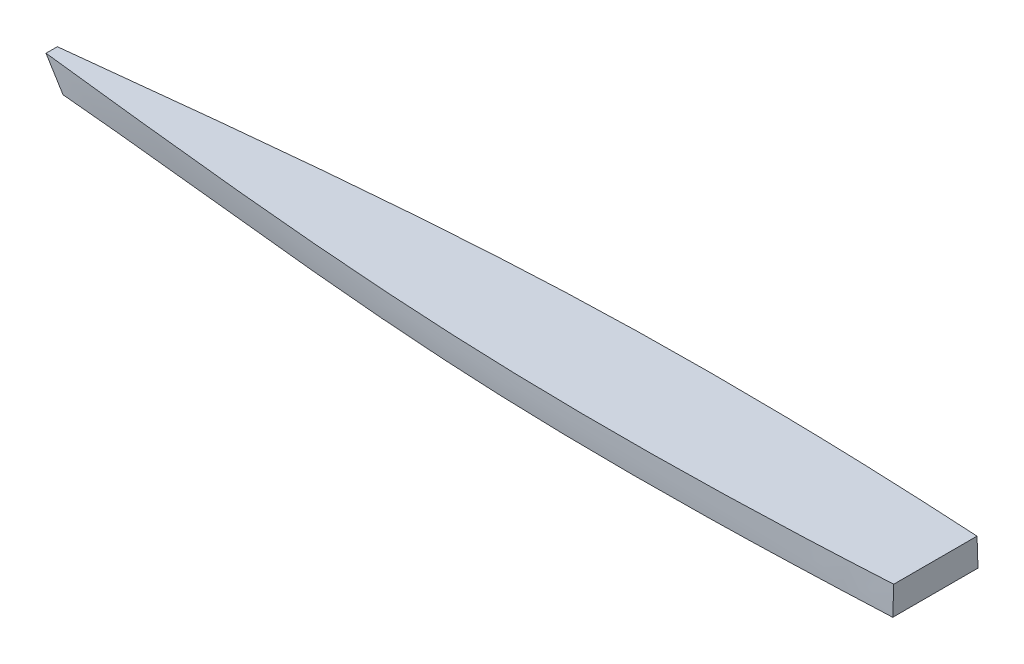
ISO-10303-21;
HEADER;
FILE_DESCRIPTION(('STEP AP214'),'2;1');
FILE_NAME('part.step','',(''),(''),'','','');
FILE_SCHEMA(('AUTOMOTIVE_DESIGN { 1 0 10303 214 1 1 1 1 }'));
ENDSEC;
DATA;
#1=APPLICATION_CONTEXT('core data for automotive mechanical design processes');
#2=APPLICATION_PROTOCOL_DEFINITION('international standard','automotive_design',2000,#1);
#3=PRODUCT_CONTEXT('',#1,'mechanical');
#4=PRODUCT('Part','Part','',(#3));
#5=PRODUCT_RELATED_PRODUCT_CATEGORY('part','',(#4));
#6=PRODUCT_DEFINITION_FORMATION('','',#4);
#7=PRODUCT_DEFINITION_CONTEXT('part definition',#1,'design');
#8=PRODUCT_DEFINITION('design','',#6,#7);
#9=PRODUCT_DEFINITION_SHAPE('','',#8);
#10=(LENGTH_UNIT() NAMED_UNIT(*) SI_UNIT(.MILLI.,.METRE.));
#11=(NAMED_UNIT(*) PLANE_ANGLE_UNIT() SI_UNIT($,.RADIAN.));
#12=(NAMED_UNIT(*) SI_UNIT($,.STERADIAN.) SOLID_ANGLE_UNIT());
#13=UNCERTAINTY_MEASURE_WITH_UNIT(LENGTH_MEASURE(1.E-05),#10,'distance_accuracy_value','');
#14=(GEOMETRIC_REPRESENTATION_CONTEXT(3) GLOBAL_UNCERTAINTY_ASSIGNED_CONTEXT((#13)) GLOBAL_UNIT_ASSIGNED_CONTEXT((#10,
#11,#12)) REPRESENTATION_CONTEXT('',''));
#15=CARTESIAN_POINT('',(0.,0.,0.));
#16=DIRECTION('',(0.,0.,1.));
#17=DIRECTION('',(1.,0.,0.));
#18=AXIS2_PLACEMENT_3D('',#15,#16,#17);
#19=CARTESIAN_POINT('',(0.,37.999248554247,0.));
#20=DIRECTION('',(0.,1.,0.));
#21=DIRECTION('',(-1.,0.,0.));
#22=AXIS2_PLACEMENT_3D('',#19,#20,#21);
#23=PLANE('',#22);
#24=DIRECTION('',(0.,0.,1.));
#25=VECTOR('',#24,1.);
#26=CARTESIAN_POINT('',(553.780953203146,37.999248554247,55.5625006612436));
#27=LINE('',#26,#25);
#28=CARTESIAN_POINT('',(553.780953203146,37.9992485520829,-57.5953656252869));
#29=VERTEX_POINT('',#28);
#30=CARTESIAN_POINT('',(553.780953203146,37.9992485520829,57.5953669477741));
#31=VERTEX_POINT('',#30);
#32=EDGE_CURVE('E93',#29,#31,#27,.T.);
#33=ORIENTED_EDGE('',*,*,#32,.T.);
#34=CARTESIAN_POINT('',(553.780953203146,37.9992485526515,57.5953671183876));
#35=CARTESIAN_POINT('',(548.773863775971,37.999248553659,57.824358610984));
#36=CARTESIAN_POINT('',(543.766651202168,37.9992485540859,58.0506555824567));
#37=CARTESIAN_POINT('',(533.751961357981,37.999248554408,58.4973462605181));
#38=CARTESIAN_POINT('',(528.744484087519,37.9992485543032,58.7177399653521));
#39=CARTESIAN_POINT('',(513.721638554495,37.9992485541346,59.3692943631397));
#40=CARTESIAN_POINT('',(503.705850107362,37.9992485542169,59.7908286362804));
#41=CARTESIAN_POINT('',(483.672408576738,37.9992485542771,60.6044770850778));
#42=CARTESIAN_POINT('',(473.654755413547,37.9992485542551,60.9965893028213));
#43=CARTESIAN_POINT('',(453.61818848432,37.9992485542389,61.7479100720035));
#44=CARTESIAN_POINT('',(443.59927471538,37.9992485542448,62.1071185461973));
#45=CARTESIAN_POINT('',(423.558710673163,37.9992485542491,62.7894791214365));
#46=CARTESIAN_POINT('',(413.537060214784,37.9992485542476,63.1126258130186));
#47=CARTESIAN_POINT('',(393.492574065518,37.9992485542464,63.7198070272983));
#48=CARTESIAN_POINT('',(383.46973837394,37.9992485542468,64.0038415270844));
#49=CARTESIAN_POINT('',(353.39953527617,37.9992485542474,64.7929838819326));
#50=CARTESIAN_POINT('',(333.35045803407,37.9992485542471,65.2351310707742));
#51=CARTESIAN_POINT('',(293.248864842879,37.9992485542469,65.9300341238479));
#52=CARTESIAN_POINT('',(273.196348872376,37.9992485542469,66.1827887626213));
#53=CARTESIAN_POINT('',(233.089626123552,37.999248554247,66.478297978267));
#54=CARTESIAN_POINT('',(213.035419344502,37.999248554247,66.5210524642347));
#55=CARTESIAN_POINT('',(182.952007699737,37.999248554247,66.4121924269231));
#56=CARTESIAN_POINT('',(172.922439422535,37.999248554247,66.347052401767));
#57=CARTESIAN_POINT('',(152.863846813173,37.999248554247,66.1564458725016));
#58=CARTESIAN_POINT('',(142.83482248177,37.999248554247,66.0309792864952));
#59=CARTESIAN_POINT('',(122.777766392741,37.999248554247,65.7170429928329));
#60=CARTESIAN_POINT('',(112.749734634197,37.999248554247,65.5285733439867));
#61=CARTESIAN_POINT('',(92.6950966983782,37.999248554247,65.0858893690443));
#62=CARTESIAN_POINT('',(82.6684905238253,37.999248554247,64.8316749190322));
#63=CARTESIAN_POINT('',(62.6179441570982,37.999248554247,64.2547091505872));
#64=CARTESIAN_POINT('',(52.5940038276793,37.999248554247,63.9319626177642));
#65=CARTESIAN_POINT('',(32.5486620068867,37.999248554247,63.2150243452051));
#66=CARTESIAN_POINT('',(22.527260518186,37.999248554247,62.8208325305578));
#67=CARTESIAN_POINT('',(2.48770007210905,37.999248554247,61.9580362865375));
#68=CARTESIAN_POINT('',(-7.53045890132251,37.999248554247,61.4894322314422));
#69=CARTESIAN_POINT('',(-27.5627845177742,37.999248554247,60.4746976271747));
#70=CARTESIAN_POINT('',(-37.576951183482,37.999248554247,59.9285675250541));
#71=CARTESIAN_POINT('',(-60.9367980204662,37.999248554247,58.5694000729219));
#72=CARTESIAN_POINT('',(-74.2808337681335,37.999248554247,57.7280591879273));
#73=CARTESIAN_POINT('',(-100.961062938043,37.999248554247,55.9279722539985));
#74=CARTESIAN_POINT('',(-114.297256284012,37.999248554247,54.9692250815748));
#75=CARTESIAN_POINT('',(-140.961708819366,37.999248554247,52.947102534316));
#76=CARTESIAN_POINT('',(-154.289967990141,37.999248554247,51.8837269150418));
#77=CARTESIAN_POINT('',(-180.939887326812,37.999248554247,49.6657053752128));
#78=CARTESIAN_POINT('',(-194.261546907812,37.999248554247,48.5110524568616));
#79=CARTESIAN_POINT('',(-220.897850834626,37.999248554247,46.1245906247097));
#80=CARTESIAN_POINT('',(-234.212495219078,37.999248554247,44.8927821404401));
#81=CARTESIAN_POINT('',(-260.835812195969,37.999248554247,42.3665664286964));
#82=CARTESIAN_POINT('',(-274.144484792539,37.999248554247,41.0721592445879));
#83=CARTESIAN_POINT('',(-297.427018531123,37.999248554247,38.7656915849122));
#84=CARTESIAN_POINT('',(-307.401915607004,37.999248554247,37.7640410310622));
#85=CARTESIAN_POINT('',(-327.349636669713,37.999248554247,35.7405297357245));
#86=CARTESIAN_POINT('',(-337.322460660645,37.999248554247,34.7186690346333));
#87=CARTESIAN_POINT('',(-357.266348039343,37.999248554247,32.6614145402096));
#88=CARTESIAN_POINT('',(-367.237411477384,37.999248554247,31.6260212330342));
#89=CARTESIAN_POINT('',(-387.178836187673,37.999248554247,29.5484544579845));
#90=CARTESIAN_POINT('',(-397.149197459533,37.999248554247,28.5062809863996));
#91=CARTESIAN_POINT('',(-424.727352724643,37.999248554247,25.6237908998356));
#92=CARTESIAN_POINT('',(-442.335160053314,37.999248554247,23.7836076708801));
#93=CARTESIAN_POINT('',(-477.554984859184,37.999248554247,20.1428633934152));
#94=CARTESIAN_POINT('',(-495.167002353155,37.999248554247,18.3423025055079));
#95=CARTESIAN_POINT('',(-521.591550700482,37.9992485542469,15.701857670938));
#96=CARTESIAN_POINT('',(-530.401054819527,37.9992485542469,14.8317531438044));
#97=CARTESIAN_POINT('',(-548.022529995455,37.999248554247,13.1169976427017));
#98=CARTESIAN_POINT('',(-556.834501048375,37.9992485542471,12.2723466280856));
#99=CARTESIAN_POINT('',(-574.461497728975,37.9992485542469,10.6138656354532));
#100=CARTESIAN_POINT('',(-583.276523404176,37.9992485542466,9.80003616085711));
#101=CARTESIAN_POINT('',(-600.909905128208,37.9992485542473,8.20874545593284));
#102=CARTESIAN_POINT('',(-609.728261196302,37.9992485542483,7.43128443930268));
#103=CARTESIAN_POINT('',(-618.54844047169,37.9992485542506,6.67477881308257));
#104=B_SPLINE_CURVE_WITH_KNOTS('',3,(#34,#35,#36,#37,#38,#39,#40,#41,#42,#43,#44,#45,#46,#47,
#48,#49,#50,#51,#52,#53,#54,#55,#56,#57,#58,#59,#60,#61,#62,#63,#64,#65,#66,#67,#68,#69,#70,#71,
#72,#73,#74,#75,#76,#77,#78,#79,#80,#81,#82,#83,#84,#85,#86,#87,#88,#89,#90,#91,#92,#93,#94,#95,
#96,#97,#98,#99,#100,#101,#102,#103),.UNSPECIFIED.,.F.,.F.,(4,2,2,2,2,2,2,2,2,2,2,2,2,2,2,2,2,2,
2,2,2,2,2,2,2,2,2,2,2,2,2,2,2,2,4),(0.,15.0369677035875,30.0739398764376,60.1478648129414,
90.2237892701159,120.299784331839,150.380284908878,180.460803106707,240.62179804013,
300.783182240113,360.944592482724,391.0337829461,421.123014257612,451.212217482685,
481.301477420356,511.388636909195,541.475827944955,571.56286765339,601.649733872876,
641.760729171095,681.872108331224,721.983581204109,762.098132220781,802.212459936461,
842.32675986312,872.401923449178,902.477026926292,932.551052913129,962.62509535956,
1015.73621199278,1068.8475438626,1095.40462206479,1121.96165785544,1148.51912722561,
1175.07675262568),.UNSPECIFIED.);
#105=CARTESIAN_POINT('',(-618.548440493532,37.9992485920826,6.6747800646999));
#106=VERTEX_POINT('',#105);
#107=EDGE_CURVE('E91',#31,#106,#104,.T.);
#108=ORIENTED_EDGE('',*,*,#107,.T.);
#109=DIRECTION('',(0.,0.,-1.));
#110=VECTOR('',#109,1.);
#111=CARTESIAN_POINT('',(-618.548440471688,37.999248554247,5.95312566124308));
#112=LINE('',#111,#110);
#113=CARTESIAN_POINT('',(-618.548440493532,37.9992485920824,-6.67477874221268));
#114=VERTEX_POINT('',#113);
#115=EDGE_CURVE('E82',#106,#114,#112,.T.);
#116=ORIENTED_EDGE('',*,*,#115,.T.);
#117=CARTESIAN_POINT('',(-618.548440471508,37.9992485540915,-6.67477749058266));
#118=CARTESIAN_POINT('',(-611.254557475778,37.9992485541911,-7.30036603929852));
#119=CARTESIAN_POINT('',(-603.961916728986,37.999248554232,-7.94029347931517));
#120=CARTESIAN_POINT('',(-589.379000600339,37.9992485542619,-9.24567333709082));
#121=CARTESIAN_POINT('',(-582.088725192894,37.999248554251,-9.91112546874787));
#122=CARTESIAN_POINT('',(-567.510278420478,37.9992485542429,-11.2644140920349));
#123=CARTESIAN_POINT('',(-560.22210704943,37.9992485542459,-11.9522505183553));
#124=CARTESIAN_POINT('',(-545.648355411309,37.999248554248,-13.3471622862599));
#125=CARTESIAN_POINT('',(-538.362774956185,37.9992485542472,-14.0542356655673));
#126=CARTESIAN_POINT('',(-523.793195976151,37.9992485542467,-15.4846653666936));
#127=CARTESIAN_POINT('',(-516.509197455393,37.9992485542469,-16.2080217307377));
#128=CARTESIAN_POINT('',(-501.942529625593,37.999248554247,-17.6680460092004));
#129=CARTESIAN_POINT('',(-494.659860317785,37.999248554247,-18.4047139359089));
#130=CARTESIAN_POINT('',(-480.095843915187,37.9992485542469,-19.8884152323871));
#131=CARTESIAN_POINT('',(-472.814496782239,37.9992485542469,-20.6354482280967));
#132=CARTESIAN_POINT('',(-458.252587353001,37.999248554247,-22.1370362078968));
#133=CARTESIAN_POINT('',(-450.972025055846,37.999248554247,-22.8915911836048));
#134=CARTESIAN_POINT('',(-436.411393123099,37.999248554247,-24.4054026049568));
#135=CARTESIAN_POINT('',(-429.131323487289,37.999248554247,-25.1646590485149));
#136=CARTESIAN_POINT('',(-414.57084632527,37.999248554247,-26.6851545849636));
#137=CARTESIAN_POINT('',(-407.290438813985,37.999248554247,-27.4463938205657));
#138=CARTESIAN_POINT('',(-392.729536388537,37.999248554247,-28.9680663389371));
#139=CARTESIAN_POINT('',(-385.44904147434,37.999248554247,-29.7284996213774));
#140=CARTESIAN_POINT('',(-370.887676564063,37.999248554247,-31.2458709953117));
#141=CARTESIAN_POINT('',(-363.606806567453,37.999248554247,-32.0028090817213));
#142=CARTESIAN_POINT('',(-345.401970577356,37.999248554247,-33.887660060014));
#143=CARTESIAN_POINT('',(-334.477605292482,37.999248554247,-35.011727034054));
#144=CARTESIAN_POINT('',(-312.626565290085,37.999248554247,-37.2372323916992));
#145=CARTESIAN_POINT('',(-301.69989057283,37.999248554247,-38.3386707779324));
#146=CARTESIAN_POINT('',(-279.843433512068,37.999248554247,-40.5103376337811));
#147=CARTESIAN_POINT('',(-268.913651168999,37.999248554247,-41.5805661078018));
#148=CARTESIAN_POINT('',(-247.050201644735,37.999248554247,-43.6814409692023));
#149=CARTESIAN_POINT('',(-236.116534438901,37.999248554247,-44.7120871008421));
#150=CARTESIAN_POINT('',(-214.246426341761,37.999248554247,-46.7254748910321));
#151=CARTESIAN_POINT('',(-203.309986109146,37.999248554247,-47.7082236855455));
#152=CARTESIAN_POINT('',(-181.432209227344,37.999248554247,-49.6180521707655));
#153=CARTESIAN_POINT('',(-170.490872567971,37.999248554247,-50.5451317451143));
#154=CARTESIAN_POINT('',(-148.603061462226,37.999248554247,-52.3359347357531));
#155=CARTESIAN_POINT('',(-137.656587043642,37.999248554247,-53.1996584908365));
#156=CARTESIAN_POINT('',(-115.758273499523,37.999248554247,-54.8563480261209));
#157=CARTESIAN_POINT('',(-104.806434378768,37.999248554247,-55.6493138692493));
#158=CARTESIAN_POINT('',(-85.0843262124903,37.999248554247,-57.0068604431564));
#159=CARTESIAN_POINT('',(-76.3150192845972,37.999248554247,-57.5854317163149));
#160=CARTESIAN_POINT('',(-58.7729808810726,37.999248554247,-58.689220116381));
#161=CARTESIAN_POINT('',(-50.0002493859864,37.999248554247,-59.2144369356225));
#162=CARTESIAN_POINT('',(-36.8387588651649,37.999248554247,-59.9597562517017));
#163=CARTESIAN_POINT('',(-32.4511951535423,37.999248554247,-60.2011117713807));
#164=CARTESIAN_POINT('',(-23.6752877472527,37.999248554247,-60.6692270817179));
#165=CARTESIAN_POINT('',(-19.2869440526793,37.999248554247,-60.8959868741274));
#166=CARTESIAN_POINT('',(-10.5095183400278,37.999248554247,-61.334634009432));
#167=CARTESIAN_POINT('',(-6.12043632277299,37.999248554247,-61.5465213688041));
#168=CARTESIAN_POINT('',(2.65840474462515,37.999248554247,-61.9557426522252));
#169=CARTESIAN_POINT('',(7.04816379485637,37.999248554247,-62.1530765743844));
#170=CARTESIAN_POINT('',(20.2183494041023,37.999248554247,-62.7236112971331));
#171=CARTESIAN_POINT('',(28.9997147288877,37.999248554247,-63.0753465649251));
#172=CARTESIAN_POINT('',(46.5665688293654,37.999248554247,-63.7236763242998));
#173=CARTESIAN_POINT('',(55.352058088976,37.999248554247,-64.0202576278254));
#174=CARTESIAN_POINT('',(72.9247113344044,37.999248554247,-64.5601354984491));
#175=CARTESIAN_POINT('',(81.7118753275772,37.999248554247,-64.8034318258701));
#176=CARTESIAN_POINT('',(99.2875143270716,37.999248554247,-65.2386523756636));
#177=CARTESIAN_POINT('',(108.075989339632,37.999248554247,-65.4305763452387));
#178=CARTESIAN_POINT('',(125.653891692456,37.999248554247,-65.7649179760481));
#179=CARTESIAN_POINT('',(134.443319034167,37.999248554247,-65.9073355610159));
#180=CARTESIAN_POINT('',(152.022764459583,37.999248554247,-66.1444902943087));
#181=CARTESIAN_POINT('',(160.812782539848,37.999248554247,-66.2392276996756));
#182=CARTESIAN_POINT('',(180.280976903077,37.999248554247,-66.3982351011177));
#183=CARTESIAN_POINT('',(190.959243158617,37.999248554247,-66.451592491942));
#184=CARTESIAN_POINT('',(212.315858508098,37.999248554247,-66.4937560135336));
#185=CARTESIAN_POINT('',(222.994207601652,37.999248554247,-66.4825623563203));
#186=CARTESIAN_POINT('',(244.350753545334,37.999248554247,-66.3987430516269));
#187=CARTESIAN_POINT('',(255.028950393296,37.999248554247,-66.3261168636163));
#188=CARTESIAN_POINT('',(276.384951314362,37.999248554247,-66.1225341719195));
#189=CARTESIAN_POINT('',(287.062755378565,37.999248554247,-65.991576744285));
#190=CARTESIAN_POINT('',(308.417731558116,37.999248554247,-65.6744452611134));
#191=CARTESIAN_POINT('',(319.09490365852,37.999248554247,-65.4882702058103));
#192=CARTESIAN_POINT('',(340.448376651938,37.999248554247,-65.0638639458922));
#193=CARTESIAN_POINT('',(351.124677528535,37.999248554247,-64.8256319194604));
#194=CARTESIAN_POINT('',(372.470657527331,37.999248554247,-64.3004947743402));
#195=CARTESIAN_POINT('',(383.140337261069,37.999248554247,-64.0136144099279));
#196=CARTESIAN_POINT('',(404.478346777991,37.999248554247,-63.3944713854109));
#197=CARTESIAN_POINT('',(415.146676564669,37.999248554247,-63.0622088452525));
#198=CARTESIAN_POINT('',(436.481762892323,37.999248554247,-62.3558638641727));
#199=CARTESIAN_POINT('',(447.148519457239,37.999248554247,-61.9817821438792));
#200=CARTESIAN_POINT('',(468.480244496932,37.999248554247,-61.1956104716839));
#201=CARTESIAN_POINT('',(479.145213022046,37.999248554247,-60.7835218806904));
#202=CARTESIAN_POINT('',(500.473160505816,37.999248554247,-59.9254626880787));
#203=CARTESIAN_POINT('',(511.136139544243,37.999248554247,-59.4794940643983));
#204=CARTESIAN_POINT('',(527.129198827629,37.999248554247,-58.7885211602315));
#205=CARTESIAN_POINT('',(532.459758583882,37.999248554247,-58.5545372122));
#206=CARTESIAN_POINT('',(543.120576497119,37.999248554247,-58.0798422782803));
#207=CARTESIAN_POINT('',(548.450834654226,37.999248554247,-57.8391312951558));
#208=CARTESIAN_POINT('',(553.780953203146,37.999248554247,-57.59536579586));
#209=B_SPLINE_CURVE_WITH_KNOTS('',3,(#117,#118,#119,#120,#121,#122,#123,#124,#125,#126,#127,
#128,#129,#130,#131,#132,#133,#134,#135,#136,#137,#138,#139,#140,#141,#142,#143,#144,#145,#146,
#147,#148,#149,#150,#151,#152,#153,#154,#155,#156,#157,#158,#159,#160,#161,#162,#163,#164,#165,
#166,#167,#168,#169,#170,#171,#172,#173,#174,#175,#176,#177,#178,#179,#180,#181,#182,#183,#184,
#185,#186,#187,#188,#189,#190,#191,#192,#193,#194,#195,#196,#197,#198,#199,#200,#201,#202,#203,
#204,#205,#206,#207,#208),.UNSPECIFIED.,.F.,.F.,(4,2,2,2,2,2,2,2,2,2,2,2,2,2,2,2,2,2,2,2,2,2,2,
2,2,2,2,2,2,2,2,2,2,2,2,2,2,2,2,2,2,2,2,2,2,4),(0.,21.9619535438301,43.9236609917359,
65.8853043688312,87.8447158732561,109.804184329617,131.763673060941,153.722371356867,
175.681045184581,197.63970927089,219.600000097448,241.560299885748,263.520631609382,
296.466747786836,329.412860138339,362.358967839739,395.305288368937,428.246685306237,
461.188151094087,494.129440715617,527.070701041039,553.435675670628,579.800802323999,
592.983373610424,606.165943315025,619.348498414459,632.531055225613,658.896077815116,
685.267396553972,711.638833909207,738.010401032845,764.382008782714,790.753474362833,
822.788460811874,854.823342041289,886.858505141016,918.894175685549,950.930426300854,
982.967182705017,1014.98768613784,1047.00810494113,1079.02797205372,1111.04669307885,
1143.06354626507,1159.0706206812,1175.0776885212),.UNSPECIFIED.);
#210=EDGE_CURVE('E88',#114,#29,#209,.T.);
#211=ORIENTED_EDGE('',*,*,#210,.T.);
#212=EDGE_LOOP('',(#33,#108,#116,#211));
#213=FACE_BOUND('',#212,.T.);
#214=ADVANCED_FACE('F39',(#213),#23,.F.);
#215=CARTESIAN_POINT('',(0.,76.099248554247,0.));
#216=DIRECTION('',(0.,1.,0.));
#217=DIRECTION('',(-1.,0.,0.));
#218=AXIS2_PLACEMENT_3D('',#215,#216,#217);
#219=PLANE('',#218);
#220=DIRECTION('',(0.,0.,1.));
#221=VECTOR('',#220,1.);
#222=CARTESIAN_POINT('',(553.780953203146,76.099248554247,55.5625006612436));
#223=LINE('',#222,#221);
#224=CARTESIAN_POINT('',(553.780953203146,76.0992485949757,-56.2915010822734));
#225=VERTEX_POINT('',#224);
#226=CARTESIAN_POINT('',(553.780953203146,76.0992485949757,56.2915024047605));
#227=VERTEX_POINT('',#226);
#228=EDGE_CURVE('E171',#225,#227,#223,.T.);
#229=ORIENTED_EDGE('',*,*,#228,.F.);
#230=CARTESIAN_POINT('',(-640.545485727318,76.0992485538189,-7.67126557632745));
#231=CARTESIAN_POINT('',(-632.416945888742,76.0992485540933,-8.58124736623067));
#232=CARTESIAN_POINT('',(-624.288550710013,76.0992485542058,-9.49251952293756));
#233=CARTESIAN_POINT('',(-608.031787523571,76.0992485542882,-11.3153751926665));
#234=CARTESIAN_POINT('',(-599.903419515891,76.099248554258,-12.2269587059801));
#235=CARTESIAN_POINT('',(-583.64646142175,76.0992485542359,-14.0481662591641));
#236=CARTESIAN_POINT('',(-575.517871335225,76.099248554244,-14.9577902984652));
#237=CARTESIAN_POINT('',(-559.260556566068,76.0992485542499,-16.7729077085187));
#238=CARTESIAN_POINT('',(-551.131831901608,76.0992485542478,-17.678401241915));
#239=CARTESIAN_POINT('',(-534.873700932175,76.0992485542462,-19.4832345195766));
#240=CARTESIAN_POINT('',(-526.744294627377,76.0992485542468,-20.3825742654325));
#241=CARTESIAN_POINT('',(-510.484583404626,76.0992485542472,-22.1731127668738));
#242=CARTESIAN_POINT('',(-502.354278486466,76.099248554247,-23.0643115206021));
#243=CARTESIAN_POINT('',(-482.027019672258,76.0992485542468,-25.2797231633218));
#244=CARTESIAN_POINT('',(-469.829377736764,76.0992485542469,-26.5976366416079));
#245=CARTESIAN_POINT('',(-445.430991449372,76.099248554247,-29.2044221997818));
#246=CARTESIAN_POINT('',(-433.230247098709,76.099248554247,-30.4932942912132));
#247=CARTESIAN_POINT('',(-408.824422798524,76.099248554247,-33.035844907156));
#248=CARTESIAN_POINT('',(-396.619342651411,76.099248554247,-34.2895215385971));
#249=CARTESIAN_POINT('',(-372.20495977332,76.099248554247,-36.7554640934822));
#250=CARTESIAN_POINT('',(-359.995657029993,76.099248554247,-37.9677298947556));
#251=CARTESIAN_POINT('',(-331.496928439449,76.099248554247,-40.7413823055425));
#252=CARTESIAN_POINT('',(-315.205693233277,76.099248554247,-42.2842606059902));
#253=CARTESIAN_POINT('',(-282.614080293706,76.099248554247,-45.2709939602072));
#254=CARTESIAN_POINT('',(-266.313702537428,76.099248554247,-46.7148487650523));
#255=CARTESIAN_POINT('',(-233.703163408372,76.099248554247,-49.4890627639229));
#256=CARTESIAN_POINT('',(-217.393001979667,76.099248554247,-50.8194213028274));
#257=CARTESIAN_POINT('',(-184.764219800344,76.099248554247,-53.3520943459828));
#258=CARTESIAN_POINT('',(-168.445599973031,76.099248554247,-54.5544206970066));
#259=CARTESIAN_POINT('',(-135.798523754923,76.099248554247,-56.8169334357098));
#260=CARTESIAN_POINT('',(-119.470067390074,76.099248554247,-57.8771201967025));
#261=CARTESIAN_POINT('',(-86.8038290985314,76.099248554247,-59.841467850722));
#262=CARTESIAN_POINT('',(-70.4660472553001,76.099248554247,-60.7456301188667));
#263=CARTESIAN_POINT('',(-47.8067620497793,76.099248554247,-61.8819676558373));
#264=CARTESIAN_POINT('',(-41.4888169369225,76.099248554247,-62.1861271075655));
#265=CARTESIAN_POINT('',(-28.8517248128534,76.099248554247,-62.7684117416635));
#266=CARTESIAN_POINT('',(-22.5325778023496,76.099248554247,-63.0465369393316));
#267=CARTESIAN_POINT('',(-9.89312387632621,76.099248554247,-63.5761014801569));
#268=CARTESIAN_POINT('',(-3.57281695337738,76.099248554247,-63.8275406459559));
#269=CARTESIAN_POINT('',(9.06878407646942,76.099248554247,-64.3041739551129));
#270=CARTESIAN_POINT('',(15.3900781836576,76.099248554247,-64.5293680907419));
#271=CARTESIAN_POINT('',(34.3553250089056,76.099248554247,-65.1661700031595));
#272=CARTESIAN_POINT('',(47.0006003082084,76.099248554247,-65.5389955344384));
#273=CARTESIAN_POINT('',(72.2936784405487,76.099248554247,-66.1844884637536));
#274=CARTESIAN_POINT('',(84.9414812729978,76.099248554247,-66.4571558850792));
#275=CARTESIAN_POINT('',(110.240879087103,76.099248554247,-66.905591232992));
#276=CARTESIAN_POINT('',(122.892474350407,76.099248554247,-67.0813432365107));
#277=CARTESIAN_POINT('',(148.196586393023,76.099248554247,-67.3390059072936));
#278=CARTESIAN_POINT('',(160.849103170449,76.099248554247,-67.4209167615271));
#279=CARTESIAN_POINT('',(186.154388253573,76.099248554247,-67.4938976955659));
#280=CARTESIAN_POINT('',(198.807156559194,76.099248554247,-67.4849678024976));
#281=CARTESIAN_POINT('',(224.11227290533,76.099248554247,-67.3791394357279));
#282=CARTESIAN_POINT('',(236.764620947197,76.099248554247,-67.2822412797962));
#283=CARTESIAN_POINT('',(262.108994899266,76.099248554247,-67.0027959071827));
#284=CARTESIAN_POINT('',(274.801017769487,76.099248554247,-66.8199746841074));
#285=CARTESIAN_POINT('',(300.183567701022,76.099248554247,-66.3713155181747));
#286=CARTESIAN_POINT('',(312.874094764942,76.099248554247,-66.105477722129));
#287=CARTESIAN_POINT('',(338.253262456628,76.099248554247,-65.4935169653743));
#288=CARTESIAN_POINT('',(350.941903075928,76.099248554247,-65.1473936546556));
#289=CARTESIAN_POINT('',(376.316909322625,76.099248554247,-64.3776721954713));
#290=CARTESIAN_POINT('',(389.003274935091,76.099248554247,-63.9540735558955));
#291=CARTESIAN_POINT('',(414.368950863335,76.099248554247,-63.0325480898213));
#292=CARTESIAN_POINT('',(427.048262107769,76.099248554247,-62.5346467517782));
#293=CARTESIAN_POINT('',(452.403854766845,76.099248554247,-61.4676724388544));
#294=CARTESIAN_POINT('',(465.080136189721,76.099248554247,-60.8985996596511));
#295=CARTESIAN_POINT('',(484.092048706821,76.099248554247,-59.9943895624507));
#296=CARTESIAN_POINT('',(490.428894876092,76.099248554247,-59.6845548104425));
#297=CARTESIAN_POINT('',(503.101769369279,76.099248554247,-59.048537053948));
#298=CARTESIAN_POINT('',(509.437797693056,76.099248554247,-58.7223540466879));
#299=CARTESIAN_POINT('',(522.10883803718,76.099248554247,-58.0541984731401));
#300=CARTESIAN_POINT('',(528.443850081495,76.099248554247,-57.7122263607672));
#301=CARTESIAN_POINT('',(541.113032674255,76.099248554247,-57.0130979041289));
#302=CARTESIAN_POINT('',(547.447203223203,76.099248554247,-56.6559415690011));
#303=CARTESIAN_POINT('',(553.780953203146,76.099248554247,-56.2914999250235));
#304=B_SPLINE_CURVE_WITH_KNOTS('',3,(#230,#231,#232,#233,#234,#235,#236,#237,#238,#239,#240,
#241,#242,#243,#244,#245,#246,#247,#248,#249,#250,#251,#252,#253,#254,#255,#256,#257,#258,#259,
#260,#261,#262,#263,#264,#265,#266,#267,#268,#269,#270,#271,#272,#273,#274,#275,#276,#277,#278,
#279,#280,#281,#282,#283,#284,#285,#286,#287,#288,#289,#290,#291,#292,#293,#294,#295,#296,#297,
#298,#299,#300,#301,#302,#303),.UNSPECIFIED.,.F.,.F.,(4,2,2,2,2,2,2,2,2,2,2,2,2,2,2,2,2,2,2,2,2,
2,2,2,2,2,2,2,2,2,2,2,2,2,2,2,4),(0.,24.5379507600793,49.0759245551283,73.6139054789095,
98.1509117000488,122.687911578482,147.224917054155,184.030788874651,220.836646065035,
257.644479166342,294.452420848968,343.544551237017,392.636805027853,441.729342168903,
490.817332840582,539.905194585779,588.992623674277,607.96837052227,626.944106219793,
645.919968024259,664.895835416962,702.847696075509,740.799547909201,778.757633322914,
816.715643108729,854.67364155976,892.631502894798,930.711240819928,968.790911402847,
1006.87074799958,1044.95082598985,1083.01787106572,1121.08481148311,1140.11804296008,
1159.15127766638,1178.18396553381,1197.21664194784),.UNSPECIFIED.);
#305=CARTESIAN_POINT('',(-640.545485728991,76.0992485562891,-7.67126575900572));
#306=VERTEX_POINT('',#305);
#307=EDGE_CURVE('E174',#306,#225,#304,.T.);
#308=ORIENTED_EDGE('',*,*,#307,.F.);
#309=DIRECTION('',(0.,0.,-1.));
#310=VECTOR('',#309,1.);
#311=CARTESIAN_POINT('',(-640.545485727813,76.099248554247,5.95312566124175));
#312=LINE('',#311,#310);
#313=CARTESIAN_POINT('',(-640.545485728992,76.0992485562892,7.67126708149292));
#314=VERTEX_POINT('',#313);
#315=EDGE_CURVE('E59',#314,#306,#312,.T.);
#316=ORIENTED_EDGE('',*,*,#315,.F.);
#317=CARTESIAN_POINT('',(553.780953203146,76.0992485542447,56.2915012475109));
#318=CARTESIAN_POINT('',(548.691400627242,76.0992485542462,56.5843476116765));
#319=CARTESIAN_POINT('',(543.601578538204,76.0992485542468,56.872495332768));
#320=CARTESIAN_POINT('',(533.42139187593,76.0992485542472,57.4390655724165));
#321=CARTESIAN_POINT('',(528.331027302553,76.0992485542471,57.7174880884207));
#322=CARTESIAN_POINT('',(513.059138934226,76.0992485542468,58.5376746390057));
#323=CARTESIAN_POINT('',(502.876800238232,76.099248554247,59.0643588440932));
#324=CARTESIAN_POINT('',(482.509373835073,76.099248554247,60.0752241969458));
#325=CARTESIAN_POINT('',(472.324285995726,76.099248554247,60.559402682073));
#326=CARTESIAN_POINT('',(451.952054602145,76.099248554247,61.4831775400791));
#327=CARTESIAN_POINT('',(441.764911041685,76.099248554247,61.9227737758264));
#328=CARTESIAN_POINT('',(421.386834624233,76.099248554247,62.7556221357843));
#329=CARTESIAN_POINT('',(411.195901414873,76.099248554247,63.1488656627537));
#330=CARTESIAN_POINT('',(390.812290076746,76.099248554247,63.8872411190141));
#331=CARTESIAN_POINT('',(380.619611946188,76.099248554247,64.2323729985718));
#332=CARTESIAN_POINT('',(350.039169140624,76.099248554247,65.1932449936613));
#333=CARTESIAN_POINT('',(329.648997550896,76.099248554247,65.734461403871));
#334=CARTESIAN_POINT('',(288.864101811881,76.099248554247,66.6065235577172));
#335=CARTESIAN_POINT('',(268.46937764818,76.099248554247,66.9373686254923));
#336=CARTESIAN_POINT('',(227.677430989963,76.099248554247,67.3774165039712));
#337=CARTESIAN_POINT('',(207.280208495252,76.099248554247,67.4866192973405));
#338=CARTESIAN_POINT('',(176.68294336357,76.099248554247,67.4753824401243));
#339=CARTESIAN_POINT('',(166.482807832377,76.099248554247,67.4424537633486));
#340=CARTESIAN_POINT('',(146.082883191789,76.099248554247,67.3166805643712));
#341=CARTESIAN_POINT('',(135.883094082687,76.099248554247,67.223835992727));
#342=CARTESIAN_POINT('',(115.484271123353,76.099248554247,66.9766373364144));
#343=CARTESIAN_POINT('',(105.285237272344,76.099248554247,66.8222833158709));
#344=CARTESIAN_POINT('',(84.88831930552,76.099248554247,66.4504177205375));
#345=CARTESIAN_POINT('',(74.6904351896736,76.099248554247,66.2329061474204));
#346=CARTESIAN_POINT('',(54.2965786959706,76.099248554247,65.7330448601313));
#347=CARTESIAN_POINT('',(44.1006062663914,76.099248554247,65.4506972722968));
#348=CARTESIAN_POINT('',(28.8082033618935,76.099248554247,64.9772680944497));
#349=CARTESIAN_POINT('',(23.7109896849912,76.099248554247,64.811140202569));
#350=CARTESIAN_POINT('',(13.5171372945412,76.099248554247,64.4620317215511));
#351=CARTESIAN_POINT('',(8.42049858099535,76.099248554247,64.2790511323539));
#352=CARTESIAN_POINT('',(-1.77212926356476,76.099248554247,63.8960435043117));
#353=CARTESIAN_POINT('',(-6.86811839568757,76.099248554247,63.6960164949566));
#354=CARTESIAN_POINT('',(-17.0593870551233,76.099248554247,63.2786467067865));
#355=CARTESIAN_POINT('',(-22.1546665825278,76.099248554247,63.0613039302081));
#356=CARTESIAN_POINT('',(-32.3444496181157,76.099248554247,62.6094701535389));
#357=CARTESIAN_POINT('',(-37.4389531285939,76.099248554247,62.3749792051854));
#358=CARTESIAN_POINT('',(-47.6271636743454,76.099248554247,61.8892741757567));
#359=CARTESIAN_POINT('',(-52.7208707093056,76.099248554247,61.6380600881229));
#360=CARTESIAN_POINT('',(-64.6045885664099,76.099248554247,61.0328535881577));
#361=CARTESIAN_POINT('',(-71.3942767439341,76.099248554247,60.6725064092039));
#362=CARTESIAN_POINT('',(-84.9721000907269,76.099248554247,59.9237013622475));
#363=CARTESIAN_POINT('',(-91.7602352592213,76.099248554247,59.5352434802614));
#364=CARTESIAN_POINT('',(-112.122276244407,76.099248554247,58.3291365391262));
#365=CARTESIAN_POINT('',(-125.693787544524,76.099248554247,57.4707557208354));
#366=CARTESIAN_POINT('',(-152.830046928349,76.099248554247,55.6532816993014));
#367=CARTESIAN_POINT('',(-166.394795001874,76.099248554247,54.6941883448642));
#368=CARTESIAN_POINT('',(-193.517885762236,76.099248554247,52.6833671846185));
#369=CARTESIAN_POINT('',(-207.076228209098,76.099248554247,51.6316361482157));
#370=CARTESIAN_POINT('',(-234.186038127279,76.099248554247,49.4438045453874));
#371=CARTESIAN_POINT('',(-247.73750562208,76.099248554247,48.3077042691125));
#372=CARTESIAN_POINT('',(-274.833800085622,76.099248554247,45.9594250948926));
#373=CARTESIAN_POINT('',(-288.37862707112,76.099248554247,44.7472463899437));
#374=CARTESIAN_POINT('',(-312.073690832685,76.099248554247,42.5669016631304));
#375=CARTESIAN_POINT('',(-322.225297969657,76.099248554247,41.6135713970536));
#376=CARTESIAN_POINT('',(-342.525177543365,76.099248554247,39.6723162401581));
#377=CARTESIAN_POINT('',(-352.673449988122,76.099248554247,38.6843914331629));
#378=CARTESIAN_POINT('',(-372.966633599849,76.099248554247,36.677477574366));
#379=CARTESIAN_POINT('',(-383.111544852488,76.099248554247,35.6584893876679));
#380=CARTESIAN_POINT('',(-403.398562038219,76.099248554247,33.5929367458321));
#381=CARTESIAN_POINT('',(-413.54066796962,76.099248554247,32.5463722740995));
#382=CARTESIAN_POINT('',(-441.763701959852,76.099248554247,29.6002106743659));
#383=CARTESIAN_POINT('',(-459.841894209587,76.099248554247,27.6744072617789));
#384=CARTESIAN_POINT('',(-495.99236470605,76.099248554247,23.7666559149249));
#385=CARTESIAN_POINT('',(-514.064642891466,76.099248554247,21.7847074161523));
#386=CARTESIAN_POINT('',(-541.170350037351,76.0992485542469,18.7856043200811));
#387=CARTESIAN_POINT('',(-550.205231234944,76.0992485542469,17.7815289553796));
#388=CARTESIAN_POINT('',(-568.274334846362,76.099248554247,15.7674624944378));
#389=CARTESIAN_POINT('',(-577.308557260146,76.0992485542471,14.7574713978251));
#390=CARTESIAN_POINT('',(-595.376531738266,76.0992485542469,12.7344790524697));
#391=CARTESIAN_POINT('',(-604.410283807528,76.0992485542465,11.7214778476461));
#392=CARTESIAN_POINT('',(-622.477793344397,76.0992485542474,9.69554588120248));
#393=CARTESIAN_POINT('',(-631.511550812002,76.0992485542486,8.68261511956341));
#394=CARTESIAN_POINT('',(-640.545485727815,76.0992485542515,7.67126689882748));
#395=B_SPLINE_CURVE_WITH_KNOTS('',3,(#317,#318,#319,#320,#321,#322,#323,#324,#325,#326,#327,
#328,#329,#330,#331,#332,#333,#334,#335,#336,#337,#338,#339,#340,#341,#342,#343,#344,#345,#346,
#347,#348,#349,#350,#351,#352,#353,#354,#355,#356,#357,#358,#359,#360,#361,#362,#363,#364,#365,
#366,#367,#368,#369,#370,#371,#372,#373,#374,#375,#376,#377,#378,#379,#380,#381,#382,#383,#384,
#385,#386,#387,#388,#389,#390,#391,#392,#393,#394),.UNSPECIFIED.,.F.,.F.,(4,2,2,2,2,2,2,2,2,2,2,
2,2,2,2,2,2,2,2,2,2,2,2,2,2,2,2,2,2,2,2,2,2,2,2,2,2,2,4),(0.,15.2939076420012,30.5878192984548,
61.1755817522859,91.7652589156075,122.355030167592,152.950466141388,183.545933741638,
244.736873443255,305.928009732392,367.119150807245,397.71957292551,428.320020295291,
458.920435763564,489.520850421305,520.120261662646,535.419999297464,550.719736986754,
566.019448208354,581.319157453712,596.618820540631,611.918489627901,632.316155322379,
652.713831163632,693.5092729502,734.304775981517,775.101702255892,815.898488233773,
856.695170722365,887.283927618339,917.872610402175,948.460442079436,979.048292164186,
1033.58958573166,1088.13142787448,1115.4029356555,1142.67444515289,1169.94555867975,
1197.21666476381),.UNSPECIFIED.);
#396=EDGE_CURVE('E100',#227,#314,#395,.T.);
#397=ORIENTED_EDGE('',*,*,#396,.F.);
#398=EDGE_LOOP('',(#229,#308,#316,#397));
#399=FACE_BOUND('',#398,.T.);
#400=ADVANCED_FACE('F159',(#399),#219,.T.);
#401=CARTESIAN_POINT('',(553.780953203146,11.0117485542469,55.5625006612436));
#402=DIRECTION('',(1.,0.,0.));
#403=DIRECTION('',(0.,0.,-1.));
#404=AXIS2_PLACEMENT_3D('',#401,#402,#403);
#405=PLANE('',#404);
#406=CARTESIAN_POINT('',(553.780953203146,-12.8007514457532,6.61243597210876E-07));
#407=CARTESIAN_POINT('',(553.780953203146,-12.8007514457532,-74.0833326720897));
#408=CARTESIAN_POINT('',(553.780953203146,8.36591522091353,-55.5624993387564));
#409=CARTESIAN_POINT('',(553.780953203146,114.199248554247,-55.5624993387564));
#410=B_SPLINE_CURVE_WITH_KNOTS('',3,(#406,#407,#408,#409),.UNSPECIFIED.,.F.,.F.,(4,4),(0.,1.),.UNSPECIFIED.);
#411=EDGE_CURVE('E182',#29,#225,#410,.T.);
#412=ORIENTED_EDGE('',*,*,#411,.T.);
#413=ORIENTED_EDGE('',*,*,#228,.T.);
#414=CARTESIAN_POINT('',(553.780953203146,-12.8007514457532,6.61243597210876E-07));
#415=CARTESIAN_POINT('',(553.780953203146,-12.8007514457532,74.0833339945769));
#416=CARTESIAN_POINT('',(553.780953203146,8.36591522091353,55.5625006612436));
#417=CARTESIAN_POINT('',(553.780953203146,114.199248554247,55.5625006612436));
#418=B_SPLINE_CURVE_WITH_KNOTS('',3,(#414,#415,#416,#417),.UNSPECIFIED.,.F.,.F.,(4,4),(0.,1.),.UNSPECIFIED.);
#419=EDGE_CURVE('E222',#31,#227,#418,.T.);
#420=ORIENTED_EDGE('',*,*,#419,.F.);
#421=ORIENTED_EDGE('',*,*,#32,.F.);
#422=EDGE_LOOP('',(#412,#413,#420,#421));
#423=FACE_BOUND('',#422,.T.);
#424=ADVANCED_FACE('F163',(#423),#405,.T.);
#425=CARTESIAN_POINT('',(553.780953203146,-12.8007514457532,6.61243597210876E-07));
#426=CARTESIAN_POINT('',(363.280953203146,-23.3840847790864,6.61243639510374E-07));
#427=CARTESIAN_POINT('',(-47.9138628846482,-33.984010045265,6.61243681876185E-07));
#428=CARTESIAN_POINT('',(-398.719046796854,-23.3840847790864,6.61243639510374E-07));
#429=CARTESIAN_POINT('',(-589.219046796854,-12.8007514457532,6.61243597210876E-07));
#430=CARTESIAN_POINT('',(553.780953203146,-12.8007514457532,-74.0833326720897));
#431=CARTESIAN_POINT('',(363.149270514041,-19.8563070013087,-78.3284004177268));
#432=CARTESIAN_POINT('',(-51.5452336226101,-37.5228491116064,-77.9584209778541));
#433=CARTESIAN_POINT('',(-390.703675687394,-19.8563070013087,-14.8284004177269));
#434=CARTESIAN_POINT('',(-589.219046796854,-12.8007514457532,-5.29166600542307));
#435=CARTESIAN_POINT('',(553.780953203146,8.36591522091353,-55.5624993387564));
#436=CARTESIAN_POINT('',(363.017587824936,4.83813744313578,-64.0526348300307));
#437=CARTESIAN_POINT('',(-40.8609521324241,39.2867906570279,-80.056732606557));
#438=CARTESIAN_POINT('',(-413.678455431684,37.347986589387,-27.010968163364));
#439=CARTESIAN_POINT('',(-620.209197650604,40.8757643671648,-7.9374993387564));
#440=CARTESIAN_POINT('',(553.780953203146,114.199248554247,-55.5624993387564));
#441=CARTESIAN_POINT('',(362.885905135831,114.199248554247,-68.2977025756679));
#442=CARTESIAN_POINT('',(-24.9367782549931,114.199248554247,-73.3539114446648));
#443=CARTESIAN_POINT('',(-447.996417655558,114.199248554247,-36.5477025756679));
#444=CARTESIAN_POINT('',(-662.542530983938,114.199248554247,-7.9374993387564));
#445=B_SPLINE_SURFACE_WITH_KNOTS('',3,3,((#425,#426,#427,#428,#429),(#430,#431,#432,#433,#434),
(#435,#436,#437,#438,#439),(#440,#441,#442,#443,#444)),.UNSPECIFIED.,.F.,.F.,.F.,(4,4),(4,1,4),
(0.,1.),(0.,0.48021814139568,1.),.UNSPECIFIED.);
#446=CARTESIAN_POINT('',(-662.542530983938,114.199248554247,-7.9374993387564));
#447=CARTESIAN_POINT('',(-620.209197650604,40.8757643671648,-7.9374993387564));
#448=CARTESIAN_POINT('',(-589.219046796854,-12.8007514457532,-5.29166600542307));
#449=CARTESIAN_POINT('',(-589.219046796854,-12.8007514457532,6.61243597210876E-07));
#450=B_SPLINE_CURVE_WITH_KNOTS('',3,(#446,#447,#448,#449),.UNSPECIFIED.,.F.,.F.,(4,4),(0.,1.),.UNSPECIFIED.);
#451=EDGE_CURVE('E51',#306,#114,#450,.T.);
#452=ORIENTED_EDGE('',*,*,#451,.F.);
#453=ORIENTED_EDGE('',*,*,#307,.T.);
#454=ORIENTED_EDGE('',*,*,#411,.F.);
#455=ORIENTED_EDGE('',*,*,#210,.F.);
#456=EDGE_LOOP('',(#452,#453,#454,#455));
#457=FACE_BOUND('',#456,.T.);
#458=ADVANCED_FACE('F125',(#457),#445,.F.);
#459=CARTESIAN_POINT('',(553.780953203146,-12.8007514457532,6.61243597210876E-07));
#460=CARTESIAN_POINT('',(363.280953203146,-23.3840847790864,6.61243554911379E-07));
#461=CARTESIAN_POINT('',(-47.9138628846482,-33.984010045265,6.61243512545567E-07));
#462=CARTESIAN_POINT('',(-398.719046796854,-23.3840847790864,6.61243554911379E-07));
#463=CARTESIAN_POINT('',(-589.219046796854,-12.8007514457532,6.61243597210876E-07));
#464=CARTESIAN_POINT('',(553.780953203146,-12.8007514457532,74.0833339945769));
#465=CARTESIAN_POINT('',(363.149270514041,-19.8563070013087,78.328401740214));
#466=CARTESIAN_POINT('',(-51.5452336226101,-37.5228491116064,77.9584223003413));
#467=CARTESIAN_POINT('',(-390.703675687394,-19.8563070013087,14.8284017402141));
#468=CARTESIAN_POINT('',(-589.219046796854,-12.8007514457532,5.29166732791026));
#469=CARTESIAN_POINT('',(553.780953203146,8.36591522091353,55.5625006612436));
#470=CARTESIAN_POINT('',(363.017587824936,4.83813744313578,64.0526361525179));
#471=CARTESIAN_POINT('',(-40.8609521324241,39.2867906570279,80.0567339290442));
#472=CARTESIAN_POINT('',(-413.678455431684,37.347986589387,27.0109694858512));
#473=CARTESIAN_POINT('',(-620.209197650604,40.8757643671648,7.9375006612436));
#474=CARTESIAN_POINT('',(553.780953203146,114.199248554247,55.5625006612436));
#475=CARTESIAN_POINT('',(362.885905135831,114.199248554247,68.2977038981551));
#476=CARTESIAN_POINT('',(-24.9367782549931,114.199248554247,73.353912767152));
#477=CARTESIAN_POINT('',(-447.996417655558,114.199248554247,36.5477038981551));
#478=CARTESIAN_POINT('',(-662.542530983938,114.199248554247,7.9375006612436));
#479=B_SPLINE_SURFACE_WITH_KNOTS('',3,3,((#459,#460,#461,#462,#463),(#464,#465,#466,#467,#468),
(#469,#470,#471,#472,#473),(#474,#475,#476,#477,#478)),.UNSPECIFIED.,.F.,.F.,.F.,(4,4),(4,1,4),
(0.,1.),(0.,0.48021814139568,1.),.UNSPECIFIED.);
#480=CARTESIAN_POINT('',(-662.542530983938,114.199248554247,7.9375006612436));
#481=CARTESIAN_POINT('',(-620.209197650604,40.8757643671648,7.9375006612436));
#482=CARTESIAN_POINT('',(-589.219046796854,-12.8007514457532,5.29166732791026));
#483=CARTESIAN_POINT('',(-589.219046796854,-12.8007514457532,6.61243597210876E-07));
#484=B_SPLINE_CURVE_WITH_KNOTS('',3,(#480,#481,#482,#483),.UNSPECIFIED.,.F.,.F.,(4,4),(0.,1.),.UNSPECIFIED.);
#485=EDGE_CURVE('E11',#314,#106,#484,.T.);
#486=ORIENTED_EDGE('',*,*,#419,.T.);
#487=ORIENTED_EDGE('',*,*,#396,.T.);
#488=ORIENTED_EDGE('',*,*,#485,.T.);
#489=ORIENTED_EDGE('',*,*,#107,.F.);
#490=EDGE_LOOP('',(#486,#487,#488,#489));
#491=FACE_BOUND('',#490,.T.);
#492=ADVANCED_FACE('F99',(#491),#479,.T.);
#493=CARTESIAN_POINT('',(-610.005788890396,23.2029419840911,5.9531256612436));
#494=DIRECTION('',(-0.866025403784437,-0.500000000000003,0.));
#495=DIRECTION('',(0.500000000000003,-0.866025403784437,0.));
#496=AXIS2_PLACEMENT_3D('',#493,#494,#495);
#497=PLANE('',#496);
#498=ORIENTED_EDGE('',*,*,#485,.F.);
#499=ORIENTED_EDGE('',*,*,#315,.T.);
#500=ORIENTED_EDGE('',*,*,#451,.T.);
#501=ORIENTED_EDGE('',*,*,#115,.F.);
#502=EDGE_LOOP('',(#498,#499,#500,#501));
#503=FACE_BOUND('',#502,.T.);
#504=ADVANCED_FACE('F41',(#503),#497,.T.);
#505=CLOSED_SHELL('',(#214,#400,#424,#458,#492,#504));
#506=MANIFOLD_SOLID_BREP('B2',#505);
#507=ADVANCED_BREP_SHAPE_REPRESENTATION('',(#18,#506),#14);
#508=SHAPE_DEFINITION_REPRESENTATION(#9,#507);
ENDSEC;
END-ISO-10303-21;
